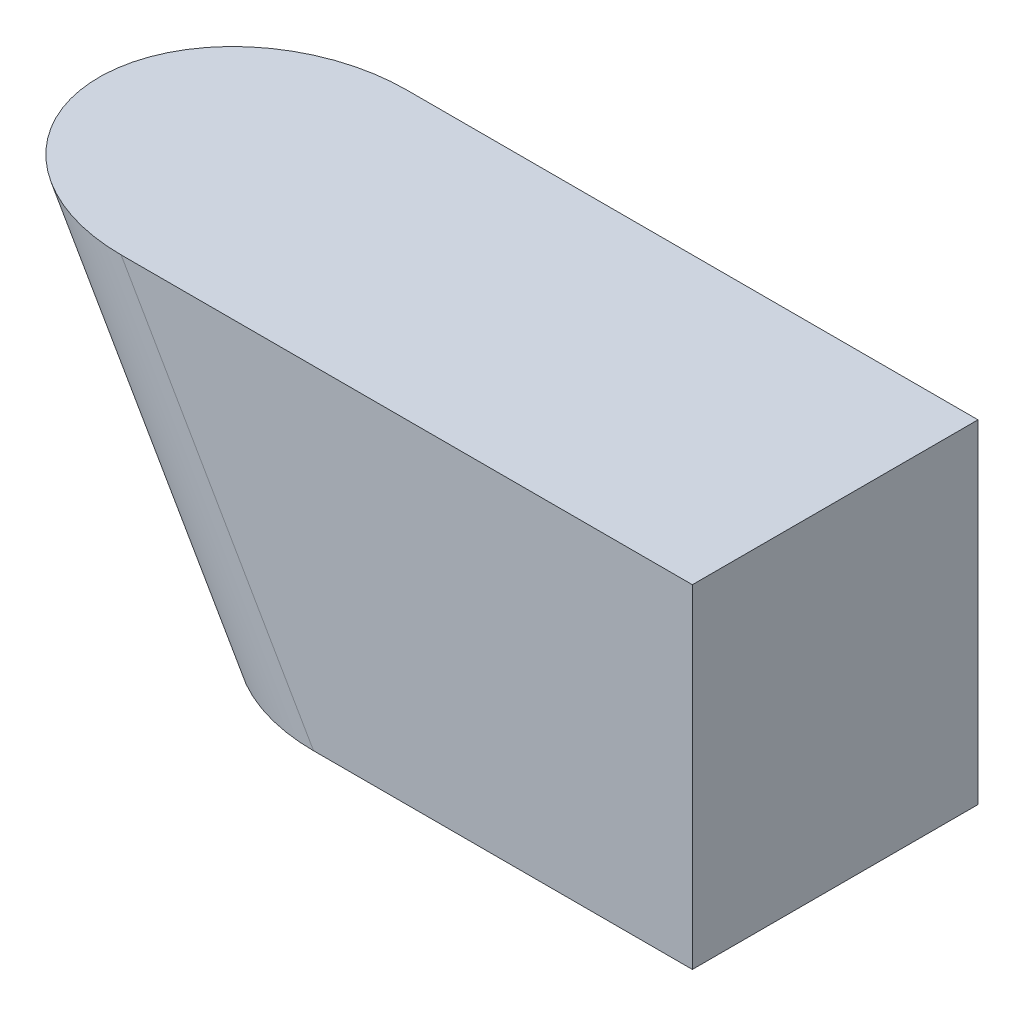
ISO-10303-21;
HEADER;
FILE_DESCRIPTION(('STEP AP214'),'2;1');
FILE_NAME('part.step','',(''),(''),'','','');
FILE_SCHEMA(('AUTOMOTIVE_DESIGN { 1 0 10303 214 1 1 1 1 }'));
ENDSEC;
DATA;
#1=APPLICATION_CONTEXT('core data for automotive mechanical design processes');
#2=APPLICATION_PROTOCOL_DEFINITION('international standard','automotive_design',2000,#1);
#3=PRODUCT_CONTEXT('',#1,'mechanical');
#4=PRODUCT('Part','Part','',(#3));
#5=PRODUCT_RELATED_PRODUCT_CATEGORY('part','',(#4));
#6=PRODUCT_DEFINITION_FORMATION('','',#4);
#7=PRODUCT_DEFINITION_CONTEXT('part definition',#1,'design');
#8=PRODUCT_DEFINITION('design','',#6,#7);
#9=PRODUCT_DEFINITION_SHAPE('','',#8);
#10=(LENGTH_UNIT() NAMED_UNIT(*) SI_UNIT(.MILLI.,.METRE.));
#11=(NAMED_UNIT(*) PLANE_ANGLE_UNIT() SI_UNIT($,.RADIAN.));
#12=(NAMED_UNIT(*) SI_UNIT($,.STERADIAN.) SOLID_ANGLE_UNIT());
#13=UNCERTAINTY_MEASURE_WITH_UNIT(LENGTH_MEASURE(1.E-05),#10,'distance_accuracy_value','');
#14=(GEOMETRIC_REPRESENTATION_CONTEXT(3) GLOBAL_UNCERTAINTY_ASSIGNED_CONTEXT((#13)) GLOBAL_UNIT_ASSIGNED_CONTEXT((#10,
#11,#12)) REPRESENTATION_CONTEXT('',''));
#15=CARTESIAN_POINT('',(0.,0.,0.));
#16=DIRECTION('',(0.,0.,1.));
#17=DIRECTION('',(1.,0.,0.));
#18=AXIS2_PLACEMENT_3D('',#15,#16,#17);
#19=CARTESIAN_POINT('',(397.927405783632,0.,150.));
#20=DIRECTION('',(0.,1.,0.));
#21=DIRECTION('',(-1.,0.,0.));
#22=AXIS2_PLACEMENT_3D('',#19,#20,#21);
#23=PLANE('',#22);
#24=DIRECTION('',(1.,0.,0.));
#25=VECTOR('',#24,1.);
#26=CARTESIAN_POINT('',(397.927405783632,0.,-150.));
#27=LINE('',#26,#25);
#28=CARTESIAN_POINT('',(-1.11022302462516E-13,0.,-150.));
#29=VERTEX_POINT('',#28);
#30=CARTESIAN_POINT('',(397.927405783632,0.,-150.));
#31=VERTEX_POINT('',#30);
#32=EDGE_CURVE('E86',#29,#31,#27,.T.);
#33=ORIENTED_EDGE('',*,*,#32,.T.);
#34=DIRECTION('',(0.,0.,-1.));
#35=VECTOR('',#34,1.);
#36=CARTESIAN_POINT('',(397.927405783632,0.,150.));
#37=LINE('',#36,#35);
#38=CARTESIAN_POINT('',(397.927405783632,0.,150.));
#39=VERTEX_POINT('',#38);
#40=EDGE_CURVE('E11',#39,#31,#37,.T.);
#41=ORIENTED_EDGE('',*,*,#40,.F.);
#42=DIRECTION('',(1.,0.,0.));
#43=VECTOR('',#42,1.);
#44=CARTESIAN_POINT('',(397.927405783632,0.,150.));
#45=LINE('',#44,#43);
#46=CARTESIAN_POINT('',(0.,0.,150.));
#47=VERTEX_POINT('',#46);
#48=EDGE_CURVE('E98',#47,#39,#45,.T.);
#49=ORIENTED_EDGE('',*,*,#48,.F.);
#50=CARTESIAN_POINT('',(0.,0.,0.));
#51=DIRECTION('',(0.,1.,0.));
#52=DIRECTION('',(-1.,0.,0.));
#53=AXIS2_PLACEMENT_3D('',#50,#51,#52);
#54=ELLIPSE('',#53,173.205080756887,150.);
#55=EDGE_CURVE('E95',#47,#29,#54,.F.);
#56=ORIENTED_EDGE('',*,*,#55,.T.);
#57=EDGE_LOOP('',(#33,#41,#49,#56));
#58=FACE_BOUND('',#57,.T.);
#59=ADVANCED_FACE('F39',(#58),#23,.F.);
#60=CARTESIAN_POINT('',(397.927405783632,350.,150.));
#61=DIRECTION('',(-1.,0.,0.));
#62=DIRECTION('',(0.,-1.,0.));
#63=AXIS2_PLACEMENT_3D('',#60,#61,#62);
#64=PLANE('',#63);
#65=DIRECTION('',(0.,1.,0.));
#66=VECTOR('',#65,1.);
#67=CARTESIAN_POINT('',(397.927405783632,350.,-150.));
#68=LINE('',#67,#66);
#69=CARTESIAN_POINT('',(397.927405783632,350.,-150.));
#70=VERTEX_POINT('',#69);
#71=EDGE_CURVE('E69',#31,#70,#68,.T.);
#72=ORIENTED_EDGE('',*,*,#71,.T.);
#73=DIRECTION('',(0.,0.,-1.));
#74=VECTOR('',#73,1.);
#75=CARTESIAN_POINT('',(397.927405783632,350.,150.));
#76=LINE('',#75,#74);
#77=CARTESIAN_POINT('',(397.927405783632,350.,150.));
#78=VERTEX_POINT('',#77);
#79=EDGE_CURVE('E48',#78,#70,#76,.T.);
#80=ORIENTED_EDGE('',*,*,#79,.F.);
#81=DIRECTION('',(0.,1.,0.));
#82=VECTOR('',#81,1.);
#83=CARTESIAN_POINT('',(397.927405783632,350.,150.));
#84=LINE('',#83,#82);
#85=EDGE_CURVE('E81',#39,#78,#84,.T.);
#86=ORIENTED_EDGE('',*,*,#85,.F.);
#87=ORIENTED_EDGE('',*,*,#40,.T.);
#88=EDGE_LOOP('',(#72,#80,#86,#87));
#89=FACE_BOUND('',#88,.T.);
#90=ADVANCED_FACE('F124',(#89),#64,.F.);
#91=CARTESIAN_POINT('',(-202.072594216368,350.,150.));
#92=DIRECTION('',(0.,-1.,0.));
#93=DIRECTION('',(0.,0.,-1.));
#94=AXIS2_PLACEMENT_3D('',#91,#92,#93);
#95=PLANE('',#94);
#96=DIRECTION('',(-1.,0.,0.));
#97=VECTOR('',#96,1.);
#98=CARTESIAN_POINT('',(-202.072594216368,350.,-150.));
#99=LINE('',#98,#97);
#100=CARTESIAN_POINT('',(-202.072594216368,350.,-150.));
#101=VERTEX_POINT('',#100);
#102=EDGE_CURVE('E76',#70,#101,#99,.T.);
#103=ORIENTED_EDGE('',*,*,#102,.T.);
#104=CARTESIAN_POINT('',(-202.072594216368,350.,0.));
#105=DIRECTION('',(0.,-1.,0.));
#106=DIRECTION('',(1.,0.,0.));
#107=AXIS2_PLACEMENT_3D('',#104,#105,#106);
#108=ELLIPSE('',#107,173.205080756887,150.);
#109=CARTESIAN_POINT('',(-202.072594216368,350.,150.));
#110=VERTEX_POINT('',#109);
#111=EDGE_CURVE('E101',#110,#101,#108,.T.);
#112=ORIENTED_EDGE('',*,*,#111,.F.);
#113=DIRECTION('',(-1.,0.,0.));
#114=VECTOR('',#113,1.);
#115=CARTESIAN_POINT('',(-202.072594216368,350.,150.));
#116=LINE('',#115,#114);
#117=EDGE_CURVE('E114',#78,#110,#116,.T.);
#118=ORIENTED_EDGE('',*,*,#117,.F.);
#119=ORIENTED_EDGE('',*,*,#79,.T.);
#120=EDGE_LOOP('',(#103,#112,#118,#119));
#121=FACE_BOUND('',#120,.T.);
#122=ADVANCED_FACE('F125',(#121),#95,.F.);
#123=CARTESIAN_POINT('',(0.,0.,150.));
#124=DIRECTION('',(0.,0.,1.));
#125=DIRECTION('',(1.,0.,0.));
#126=AXIS2_PLACEMENT_3D('',#123,#124,#125);
#127=PLANE('',#126);
#128=ORIENTED_EDGE('',*,*,#48,.T.);
#129=ORIENTED_EDGE('',*,*,#85,.T.);
#130=ORIENTED_EDGE('',*,*,#117,.T.);
#131=DIRECTION('',(0.499999999999998,-0.86602540378444,0.));
#132=VECTOR('',#131,1.);
#133=CARTESIAN_POINT('',(0.,0.,150.));
#134=LINE('',#133,#132);
#135=EDGE_CURVE('E56',#110,#47,#134,.T.);
#136=ORIENTED_EDGE('',*,*,#135,.T.);
#137=EDGE_LOOP('',(#128,#129,#130,#136));
#138=FACE_BOUND('',#137,.T.);
#139=ADVANCED_FACE('F123',(#138),#127,.T.);
#140=CARTESIAN_POINT('',(0.,0.,-150.));
#141=DIRECTION('',(0.,0.,1.));
#142=DIRECTION('',(1.,0.,0.));
#143=AXIS2_PLACEMENT_3D('',#140,#141,#142);
#144=PLANE('',#143);
#145=ORIENTED_EDGE('',*,*,#32,.F.);
#146=DIRECTION('',(0.499999999999998,-0.86602540378444,0.));
#147=VECTOR('',#146,1.);
#148=CARTESIAN_POINT('',(0.,0.,-150.));
#149=LINE('',#148,#147);
#150=EDGE_CURVE('E90',#101,#29,#149,.T.);
#151=ORIENTED_EDGE('',*,*,#150,.F.);
#152=ORIENTED_EDGE('',*,*,#102,.F.);
#153=ORIENTED_EDGE('',*,*,#71,.F.);
#154=EDGE_LOOP('',(#145,#151,#152,#153));
#155=FACE_BOUND('',#154,.T.);
#156=ADVANCED_FACE('F88',(#155),#144,.F.);
#157=CARTESIAN_POINT('',(159.026497716816,-275.441973795263,0.));
#158=DIRECTION('',(-0.499999999999998,0.86602540378444,0.));
#159=DIRECTION('',(-0.86602540378444,-0.499999999999998,0.));
#160=AXIS2_PLACEMENT_3D('',#157,#158,#159);
#161=CYLINDRICAL_SURFACE('',#160,150.);
#162=ORIENTED_EDGE('',*,*,#55,.F.);
#163=ORIENTED_EDGE('',*,*,#135,.F.);
#164=ORIENTED_EDGE('',*,*,#111,.T.);
#165=ORIENTED_EDGE('',*,*,#150,.T.);
#166=EDGE_LOOP('',(#162,#163,#164,#165));
#167=FACE_BOUND('',#166,.T.);
#168=ADVANCED_FACE('F103',(#167),#161,.T.);
#169=CLOSED_SHELL('',(#59,#90,#122,#139,#156,#168));
#170=MANIFOLD_SOLID_BREP('B2',#169);
#171=ADVANCED_BREP_SHAPE_REPRESENTATION('',(#18,#170),#14);
#172=SHAPE_DEFINITION_REPRESENTATION(#9,#171);
ENDSEC;
END-ISO-10303-21;
